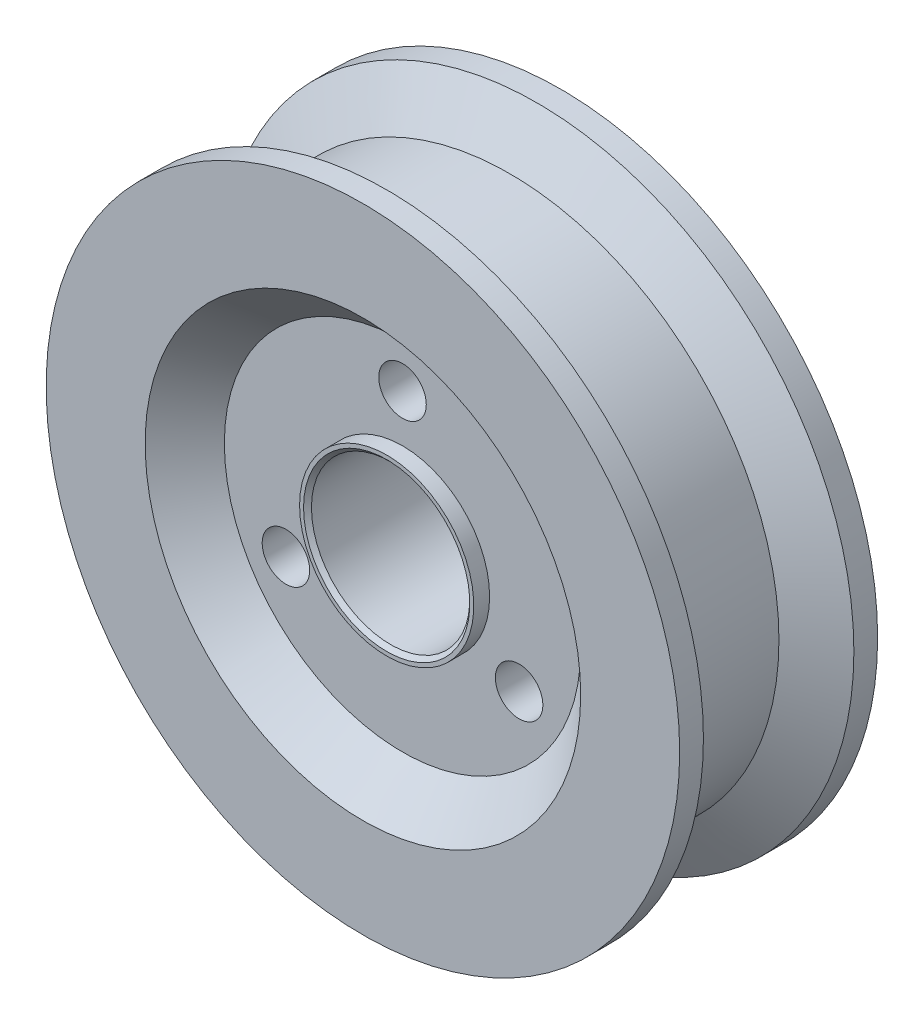
ISO-10303-21;
HEADER;
FILE_DESCRIPTION(('STEP AP214'),'2;1');
FILE_NAME('part.step','',(''),(''),'','','');
FILE_SCHEMA(('AUTOMOTIVE_DESIGN { 1 0 10303 214 1 1 1 1 }'));
ENDSEC;
DATA;
#1=APPLICATION_CONTEXT('core data for automotive mechanical design processes');
#2=APPLICATION_PROTOCOL_DEFINITION('international standard','automotive_design',2000,#1);
#3=PRODUCT_CONTEXT('',#1,'mechanical');
#4=PRODUCT('Part','Part','',(#3));
#5=PRODUCT_RELATED_PRODUCT_CATEGORY('part','',(#4));
#6=PRODUCT_DEFINITION_FORMATION('','',#4);
#7=PRODUCT_DEFINITION_CONTEXT('part definition',#1,'design');
#8=PRODUCT_DEFINITION('design','',#6,#7);
#9=PRODUCT_DEFINITION_SHAPE('','',#8);
#10=(LENGTH_UNIT() NAMED_UNIT(*) SI_UNIT(.MILLI.,.METRE.));
#11=(NAMED_UNIT(*) PLANE_ANGLE_UNIT() SI_UNIT($,.RADIAN.));
#12=(NAMED_UNIT(*) SI_UNIT($,.STERADIAN.) SOLID_ANGLE_UNIT());
#13=UNCERTAINTY_MEASURE_WITH_UNIT(LENGTH_MEASURE(1.E-05),#10,'distance_accuracy_value','');
#14=(GEOMETRIC_REPRESENTATION_CONTEXT(3) GLOBAL_UNCERTAINTY_ASSIGNED_CONTEXT((#13)) GLOBAL_UNIT_ASSIGNED_CONTEXT((#10,
#11,#12)) REPRESENTATION_CONTEXT('',''));
#15=CARTESIAN_POINT('',(0.,0.,0.));
#16=DIRECTION('',(0.,0.,1.));
#17=DIRECTION('',(1.,0.,0.));
#18=AXIS2_PLACEMENT_3D('',#15,#16,#17);
#19=CARTESIAN_POINT('',(0.,0.,9.895));
#20=DIRECTION('',(0.,0.,-1.));
#21=DIRECTION('',(-1.,0.,0.));
#22=AXIS2_PLACEMENT_3D('',#19,#20,#21);
#23=CYLINDRICAL_SURFACE('',#22,31.664);
#24=CARTESIAN_POINT('',(0.,0.,-7.5202));
#25=DIRECTION('',(0.,0.,1.));
#26=DIRECTION('',(1.,0.,0.));
#27=AXIS2_PLACEMENT_3D('',#24,#25,#26);
#28=CIRCLE('',#27,31.664);
#29=CARTESIAN_POINT('',(31.664,0.,-7.5202));
#30=VERTEX_POINT('',#29);
#31=EDGE_CURVE('E95',#30,#30,#28,.T.);
#32=ORIENTED_EDGE('',*,*,#31,.F.);
#33=EDGE_LOOP('',(#32));
#34=FACE_BOUND('',#33,.T.);
#35=CARTESIAN_POINT('',(0.,0.,-9.895));
#36=DIRECTION('',(0.,0.,1.));
#37=DIRECTION('',(1.,0.,0.));
#38=AXIS2_PLACEMENT_3D('',#35,#36,#37);
#39=CIRCLE('',#38,31.664);
#40=CARTESIAN_POINT('',(31.664,0.,-9.895));
#41=VERTEX_POINT('',#40);
#42=EDGE_CURVE('E80',#41,#41,#39,.T.);
#43=ORIENTED_EDGE('',*,*,#42,.T.);
#44=EDGE_LOOP('',(#43));
#45=FACE_BOUND('',#44,.T.);
#46=ADVANCED_FACE('F42',(#34,#45),#23,.T.);
#47=CARTESIAN_POINT('',(0.,0.,9.895));
#48=DIRECTION('',(0.,0.,1.));
#49=DIRECTION('',(1.,0.,0.));
#50=AXIS2_PLACEMENT_3D('',#47,#48,#49);
#51=PLANE('',#50);
#52=CARTESIAN_POINT('',(0.,0.,9.895));
#53=DIRECTION('',(0.,0.,1.));
#54=DIRECTION('',(1.,0.,0.));
#55=AXIS2_PLACEMENT_3D('',#52,#53,#54);
#56=CIRCLE('',#55,21.769);
#57=CARTESIAN_POINT('',(21.769,0.,9.895));
#58=VERTEX_POINT('',#57);
#59=EDGE_CURVE('E75',#58,#58,#56,.F.);
#60=ORIENTED_EDGE('',*,*,#59,.T.);
#61=EDGE_LOOP('',(#60));
#62=FACE_BOUND('',#61,.T.);
#63=CARTESIAN_POINT('',(0.,0.,9.895));
#64=DIRECTION('',(0.,0.,1.));
#65=DIRECTION('',(1.,0.,0.));
#66=AXIS2_PLACEMENT_3D('',#63,#64,#65);
#67=CIRCLE('',#66,31.664);
#68=CARTESIAN_POINT('',(31.664,0.,9.895));
#69=VERTEX_POINT('',#68);
#70=EDGE_CURVE('E79',#69,#69,#67,.T.);
#71=ORIENTED_EDGE('',*,*,#70,.T.);
#72=EDGE_LOOP('',(#71));
#73=FACE_BOUND('',#72,.T.);
#74=ADVANCED_FACE('F168',(#62,#73),#51,.T.);
#75=CARTESIAN_POINT('',(0.,0.,-9.895));
#76=DIRECTION('',(0.,0.,1.));
#77=DIRECTION('',(1.,0.,0.));
#78=AXIS2_PLACEMENT_3D('',#75,#76,#77);
#79=PLANE('',#78);
#80=CARTESIAN_POINT('',(0.,0.,-9.895));
#81=DIRECTION('',(0.,0.,1.));
#82=DIRECTION('',(1.,0.,0.));
#83=AXIS2_PLACEMENT_3D('',#80,#81,#82);
#84=CIRCLE('',#83,21.769);
#85=CARTESIAN_POINT('',(-21.769,0.,-9.895));
#86=VERTEX_POINT('',#85);
#87=EDGE_CURVE('E71',#86,#86,#84,.T.);
#88=ORIENTED_EDGE('',*,*,#87,.T.);
#89=EDGE_LOOP('',(#88));
#90=FACE_BOUND('',#89,.T.);
#91=ORIENTED_EDGE('',*,*,#42,.F.);
#92=EDGE_LOOP('',(#91));
#93=FACE_BOUND('',#92,.T.);
#94=ADVANCED_FACE('F175',(#90,#93),#79,.F.);
#95=CARTESIAN_POINT('',(0.,0.,7.5202));
#96=DIRECTION('',(0.,0.,1.));
#97=DIRECTION('',(1.,0.,0.));
#98=AXIS2_PLACEMENT_3D('',#95,#96,#97);
#99=CIRCLE('',#98,31.664);
#100=CARTESIAN_POINT('',(31.664,0.,7.5202));
#101=VERTEX_POINT('',#100);
#102=EDGE_CURVE('E107',#101,#101,#99,.T.);
#103=ORIENTED_EDGE('',*,*,#102,.T.);
#104=EDGE_LOOP('',(#103));
#105=FACE_BOUND('',#104,.T.);
#106=ORIENTED_EDGE('',*,*,#70,.F.);
#107=EDGE_LOOP('',(#106));
#108=FACE_BOUND('',#107,.T.);
#109=ADVANCED_FACE('F171',(#105,#108),#23,.T.);
#110=CARTESIAN_POINT('',(0.,0.,5.937));
#111=DIRECTION('',(0.,0.,1.));
#112=DIRECTION('',(1.,0.,0.));
#113=AXIS2_PLACEMENT_3D('',#110,#111,#112);
#114=PLANE('',#113);
#115=CARTESIAN_POINT('',(0.,0.,5.937));
#116=DIRECTION('',(0.,0.,1.));
#117=DIRECTION('',(1.,0.,0.));
#118=AXIS2_PLACEMENT_3D('',#115,#116,#117);
#119=CIRCLE('',#118,8.7076);
#120=CARTESIAN_POINT('',(8.7076,0.,5.937));
#121=VERTEX_POINT('',#120);
#122=EDGE_CURVE('E66',#121,#121,#119,.T.);
#123=ORIENTED_EDGE('',*,*,#122,.F.);
#124=EDGE_LOOP('',(#123));
#125=FACE_BOUND('',#124,.T.);
#126=CARTESIAN_POINT('',(0.,13.4572,5.937));
#127=DIRECTION('',(0.,0.,1.));
#128=DIRECTION('',(1.,0.,0.));
#129=AXIS2_PLACEMENT_3D('',#126,#127,#128);
#130=CIRCLE('',#129,2.3748);
#131=CARTESIAN_POINT('',(2.3748,13.4572,5.937));
#132=VERTEX_POINT('',#131);
#133=EDGE_CURVE('E111',#132,#132,#130,.T.);
#134=ORIENTED_EDGE('',*,*,#133,.F.);
#135=EDGE_LOOP('',(#134));
#136=FACE_BOUND('',#135,.T.);
#137=CARTESIAN_POINT('',(-11.6542770638079,-6.7285999999995,5.937));
#138=DIRECTION('',(0.,0.,1.));
#139=DIRECTION('',(1.,0.,0.));
#140=AXIS2_PLACEMENT_3D('',#137,#138,#139);
#141=CIRCLE('',#140,2.37480000000055);
#142=CARTESIAN_POINT('',(-9.2794770638074,-6.7285999999995,5.937));
#143=VERTEX_POINT('',#142);
#144=EDGE_CURVE('E115',#143,#143,#141,.T.);
#145=ORIENTED_EDGE('',*,*,#144,.F.);
#146=EDGE_LOOP('',(#145));
#147=FACE_BOUND('',#146,.T.);
#148=CARTESIAN_POINT('',(11.6542770638075,-6.72859999999975,5.937));
#149=DIRECTION('',(0.,0.,1.));
#150=DIRECTION('',(1.,0.,0.));
#151=AXIS2_PLACEMENT_3D('',#148,#149,#150);
#152=CIRCLE('',#151,2.37480000000027);
#153=CARTESIAN_POINT('',(14.0290770638078,-6.72859999999975,5.937));
#154=VERTEX_POINT('',#153);
#155=EDGE_CURVE('E119',#154,#154,#152,.T.);
#156=ORIENTED_EDGE('',*,*,#155,.F.);
#157=EDGE_LOOP('',(#156));
#158=FACE_BOUND('',#157,.T.);
#159=CARTESIAN_POINT('',(0.,0.,5.937));
#160=DIRECTION('',(0.,0.,1.));
#161=DIRECTION('',(1.,0.,0.));
#162=AXIS2_PLACEMENT_3D('',#159,#160,#161);
#163=CIRCLE('',#162,17.811);
#164=CARTESIAN_POINT('',(17.811,0.,5.937));
#165=VERTEX_POINT('',#164);
#166=EDGE_CURVE('E84',#165,#165,#163,.T.);
#167=ORIENTED_EDGE('',*,*,#166,.T.);
#168=EDGE_LOOP('',(#167));
#169=FACE_BOUND('',#168,.T.);
#170=ADVANCED_FACE('F183',(#125,#136,#147,#158,#169),#114,.T.);
#171=CARTESIAN_POINT('',(0.,0.,-5.937));
#172=DIRECTION('',(0.,0.,-1.));
#173=DIRECTION('',(1.,0.,0.));
#174=AXIS2_PLACEMENT_3D('',#171,#172,#173);
#175=PLANE('',#174);
#176=CARTESIAN_POINT('',(0.,0.,-5.937));
#177=DIRECTION('',(0.,0.,-1.));
#178=DIRECTION('',(-1.,0.,0.));
#179=AXIS2_PLACEMENT_3D('',#176,#177,#178);
#180=CIRCLE('',#179,8.7076);
#181=CARTESIAN_POINT('',(-8.7076,0.,-5.937));
#182=VERTEX_POINT('',#181);
#183=EDGE_CURVE('E67',#182,#182,#180,.T.);
#184=ORIENTED_EDGE('',*,*,#183,.F.);
#185=EDGE_LOOP('',(#184));
#186=FACE_BOUND('',#185,.T.);
#187=CARTESIAN_POINT('',(0.,13.4572,-5.937));
#188=DIRECTION('',(0.,0.,-1.));
#189=DIRECTION('',(-1.,0.,0.));
#190=AXIS2_PLACEMENT_3D('',#187,#188,#189);
#191=CIRCLE('',#190,2.3748);
#192=CARTESIAN_POINT('',(-2.3748,13.4572,-5.937));
#193=VERTEX_POINT('',#192);
#194=EDGE_CURVE('E123',#193,#193,#191,.T.);
#195=ORIENTED_EDGE('',*,*,#194,.F.);
#196=EDGE_LOOP('',(#195));
#197=FACE_BOUND('',#196,.T.);
#198=CARTESIAN_POINT('',(-11.6542770638079,-6.7285999999995,-5.937));
#199=DIRECTION('',(0.,0.,-1.));
#200=DIRECTION('',(-1.,0.,0.));
#201=AXIS2_PLACEMENT_3D('',#198,#199,#200);
#202=CIRCLE('',#201,2.37480000000055);
#203=CARTESIAN_POINT('',(-14.0290770638085,-6.7285999999995,-5.937));
#204=VERTEX_POINT('',#203);
#205=EDGE_CURVE('E128',#204,#204,#202,.T.);
#206=ORIENTED_EDGE('',*,*,#205,.F.);
#207=EDGE_LOOP('',(#206));
#208=FACE_BOUND('',#207,.T.);
#209=CARTESIAN_POINT('',(11.6542770638075,-6.72859999999975,-5.937));
#210=DIRECTION('',(0.,0.,-1.));
#211=DIRECTION('',(-1.,0.,0.));
#212=AXIS2_PLACEMENT_3D('',#209,#210,#211);
#213=CIRCLE('',#212,2.37480000000027);
#214=CARTESIAN_POINT('',(9.27947706380725,-6.72859999999975,-5.937));
#215=VERTEX_POINT('',#214);
#216=EDGE_CURVE('E124',#215,#215,#213,.T.);
#217=ORIENTED_EDGE('',*,*,#216,.F.);
#218=EDGE_LOOP('',(#217));
#219=FACE_BOUND('',#218,.T.);
#220=CARTESIAN_POINT('',(0.,0.,-5.937));
#221=DIRECTION('',(0.,0.,1.));
#222=DIRECTION('',(1.,0.,0.));
#223=AXIS2_PLACEMENT_3D('',#220,#221,#222);
#224=CIRCLE('',#223,17.811);
#225=CARTESIAN_POINT('',(-17.811,0.,-5.937));
#226=VERTEX_POINT('',#225);
#227=EDGE_CURVE('E91',#226,#226,#224,.T.);
#228=ORIENTED_EDGE('',*,*,#227,.F.);
#229=EDGE_LOOP('',(#228));
#230=FACE_BOUND('',#229,.T.);
#231=ADVANCED_FACE('F189',(#186,#197,#208,#219,#230),#175,.T.);
#232=CARTESIAN_POINT('',(0.,0.,-7.5202));
#233=DIRECTION('',(0.,0.,-1.));
#234=DIRECTION('',(-1.,0.,0.));
#235=AXIS2_PLACEMENT_3D('',#232,#233,#234);
#236=CONICAL_SURFACE('',#235,31.664,1.04719755119659);
#237=CARTESIAN_POINT('',(0.,0.,-4.77801716145693));
#238=DIRECTION('',(0.,0.,1.));
#239=DIRECTION('',(1.,0.,0.));
#240=AXIS2_PLACEMENT_3D('',#237,#238,#239);
#241=CIRCLE('',#240,26.9144);
#242=CARTESIAN_POINT('',(26.9144,0.,-4.77801716145693));
#243=VERTEX_POINT('',#242);
#244=EDGE_CURVE('E99',#243,#243,#241,.T.);
#245=ORIENTED_EDGE('',*,*,#244,.F.);
#246=EDGE_LOOP('',(#245));
#247=FACE_BOUND('',#246,.T.);
#248=ORIENTED_EDGE('',*,*,#31,.T.);
#249=EDGE_LOOP('',(#248));
#250=FACE_BOUND('',#249,.T.);
#251=ADVANCED_FACE('F208',(#247,#250),#236,.T.);
#252=CARTESIAN_POINT('',(0.,0.,0.));
#253=DIRECTION('',(0.,0.,1.));
#254=DIRECTION('',(1.,0.,0.));
#255=AXIS2_PLACEMENT_3D('',#252,#253,#254);
#256=CYLINDRICAL_SURFACE('',#255,26.9144);
#257=CARTESIAN_POINT('',(0.,0.,4.77801716145692));
#258=DIRECTION('',(0.,0.,1.));
#259=DIRECTION('',(1.,0.,0.));
#260=AXIS2_PLACEMENT_3D('',#257,#258,#259);
#261=CIRCLE('',#260,26.9144);
#262=CARTESIAN_POINT('',(26.9144,0.,4.77801716145692));
#263=VERTEX_POINT('',#262);
#264=EDGE_CURVE('E103',#263,#263,#261,.T.);
#265=ORIENTED_EDGE('',*,*,#264,.F.);
#266=EDGE_LOOP('',(#265));
#267=FACE_BOUND('',#266,.T.);
#268=ORIENTED_EDGE('',*,*,#244,.T.);
#269=EDGE_LOOP('',(#268));
#270=FACE_BOUND('',#269,.T.);
#271=ADVANCED_FACE('F202',(#267,#270),#256,.T.);
#272=CARTESIAN_POINT('',(0.,0.,4.77801716145692));
#273=DIRECTION('',(0.,0.,1.));
#274=DIRECTION('',(1.,0.,0.));
#275=AXIS2_PLACEMENT_3D('',#272,#273,#274);
#276=CONICAL_SURFACE('',#275,26.9144,1.04719755119659);
#277=ORIENTED_EDGE('',*,*,#102,.F.);
#278=EDGE_LOOP('',(#277));
#279=FACE_BOUND('',#278,.T.);
#280=ORIENTED_EDGE('',*,*,#264,.T.);
#281=EDGE_LOOP('',(#280));
#282=FACE_BOUND('',#281,.T.);
#283=ADVANCED_FACE('F198',(#279,#282),#276,.T.);
#284=CARTESIAN_POINT('',(0.,0.,5.93700000000002));
#285=DIRECTION('',(0.,0.,1.));
#286=DIRECTION('',(1.,0.,0.));
#287=AXIS2_PLACEMENT_3D('',#284,#285,#286);
#288=CONICAL_SURFACE('',#287,17.811,0.78539816339745);
#289=ORIENTED_EDGE('',*,*,#59,.F.);
#290=EDGE_LOOP('',(#289));
#291=FACE_BOUND('',#290,.T.);
#292=ORIENTED_EDGE('',*,*,#166,.F.);
#293=EDGE_LOOP('',(#292));
#294=FACE_BOUND('',#293,.T.);
#295=ADVANCED_FACE('F201',(#291,#294),#288,.F.);
#296=CARTESIAN_POINT('',(0.,0.,-9.895));
#297=DIRECTION('',(0.,0.,-1.));
#298=DIRECTION('',(-1.,0.,0.));
#299=AXIS2_PLACEMENT_3D('',#296,#297,#298);
#300=CONICAL_SURFACE('',#299,21.769,0.785398163397447);
#301=CARTESIAN_POINT('',(-17.811,0.,-5.937));
#302=CARTESIAN_POINT('',(-17.8522291666667,0.,-5.97822916666667));
#303=CARTESIAN_POINT('',(-17.8934583333334,0.,-6.01945833333333));
#304=CARTESIAN_POINT('',(-17.9759166666667,0.,-6.10191666666667));
#305=CARTESIAN_POINT('',(-18.0171458333334,0.,-6.14314583333333));
#306=CARTESIAN_POINT('',(-18.0996041666667,0.,-6.22560416666667));
#307=CARTESIAN_POINT('',(-18.1408333333334,0.,-6.26683333333333));
#308=CARTESIAN_POINT('',(-18.2232916666667,0.,-6.34929166666667));
#309=CARTESIAN_POINT('',(-18.2645208333334,0.,-6.39052083333333));
#310=CARTESIAN_POINT('',(-18.3469791666667,0.,-6.47297916666667));
#311=CARTESIAN_POINT('',(-18.3882083333333,0.,-6.51420833333333));
#312=CARTESIAN_POINT('',(-18.4706666666667,0.,-6.59666666666667));
#313=CARTESIAN_POINT('',(-18.5118958333334,0.,-6.63789583333333));
#314=CARTESIAN_POINT('',(-18.5943541666667,0.,-6.72035416666667));
#315=CARTESIAN_POINT('',(-18.6355833333334,0.,-6.76158333333333));
#316=CARTESIAN_POINT('',(-18.7180416666667,0.,-6.84404166666667));
#317=CARTESIAN_POINT('',(-18.7592708333334,0.,-6.88527083333333));
#318=CARTESIAN_POINT('',(-18.8417291666667,0.,-6.96772916666667));
#319=CARTESIAN_POINT('',(-18.8829583333333,0.,-7.00895833333333));
#320=CARTESIAN_POINT('',(-18.9654166666667,0.,-7.09141666666667));
#321=CARTESIAN_POINT('',(-19.0066458333333,0.,-7.13264583333333));
#322=CARTESIAN_POINT('',(-19.0891041666667,0.,-7.21510416666667));
#323=CARTESIAN_POINT('',(-19.1303333333334,0.,-7.25633333333333));
#324=CARTESIAN_POINT('',(-19.2127916666667,0.,-7.33879166666667));
#325=CARTESIAN_POINT('',(-19.2540208333333,0.,-7.38002083333333));
#326=CARTESIAN_POINT('',(-19.3364791666667,0.,-7.46247916666667));
#327=CARTESIAN_POINT('',(-19.3777083333333,0.,-7.50370833333333));
#328=CARTESIAN_POINT('',(-19.4601666666667,0.,-7.58616666666667));
#329=CARTESIAN_POINT('',(-19.5013958333333,0.,-7.62739583333333));
#330=CARTESIAN_POINT('',(-19.5838541666667,0.,-7.70985416666667));
#331=CARTESIAN_POINT('',(-19.6250833333334,0.,-7.75108333333333));
#332=CARTESIAN_POINT('',(-19.7075416666667,0.,-7.83354166666667));
#333=CARTESIAN_POINT('',(-19.7487708333333,0.,-7.87477083333333));
#334=CARTESIAN_POINT('',(-19.8312291666667,0.,-7.95722916666667));
#335=CARTESIAN_POINT('',(-19.8724583333333,0.,-7.99845833333333));
#336=CARTESIAN_POINT('',(-19.9549166666667,0.,-8.08091666666667));
#337=CARTESIAN_POINT('',(-19.9961458333333,0.,-8.12214583333333));
#338=CARTESIAN_POINT('',(-20.0786041666667,0.,-8.20460416666667));
#339=CARTESIAN_POINT('',(-20.1198333333333,0.,-8.24583333333333));
#340=CARTESIAN_POINT('',(-20.2022916666667,0.,-8.32829166666667));
#341=CARTESIAN_POINT('',(-20.2435208333333,0.,-8.36952083333333));
#342=CARTESIAN_POINT('',(-20.3259791666667,0.,-8.45197916666667));
#343=CARTESIAN_POINT('',(-20.3672083333333,0.,-8.49320833333334));
#344=CARTESIAN_POINT('',(-20.4496666666667,0.,-8.57566666666667));
#345=CARTESIAN_POINT('',(-20.4908958333333,0.,-8.61689583333333));
#346=CARTESIAN_POINT('',(-20.5733541666667,0.,-8.69935416666667));
#347=CARTESIAN_POINT('',(-20.6145833333333,0.,-8.74058333333334));
#348=CARTESIAN_POINT('',(-20.6970416666667,0.,-8.82304166666667));
#349=CARTESIAN_POINT('',(-20.7382708333333,0.,-8.86427083333334));
#350=CARTESIAN_POINT('',(-20.8207291666667,0.,-8.94672916666667));
#351=CARTESIAN_POINT('',(-20.8619583333333,0.,-8.98795833333333));
#352=CARTESIAN_POINT('',(-20.9444166666667,0.,-9.07041666666667));
#353=CARTESIAN_POINT('',(-20.9856458333333,0.,-9.11164583333333));
#354=CARTESIAN_POINT('',(-21.0681041666667,0.,-9.19410416666667));
#355=CARTESIAN_POINT('',(-21.1093333333333,0.,-9.23533333333333));
#356=CARTESIAN_POINT('',(-21.1917916666667,0.,-9.31779166666667));
#357=CARTESIAN_POINT('',(-21.2330208333333,0.,-9.35902083333334));
#358=CARTESIAN_POINT('',(-21.3154791666667,0.,-9.44147916666667));
#359=CARTESIAN_POINT('',(-21.3567083333333,0.,-9.48270833333333));
#360=CARTESIAN_POINT('',(-21.4391666666667,0.,-9.56516666666667));
#361=CARTESIAN_POINT('',(-21.4803958333333,0.,-9.60639583333334));
#362=CARTESIAN_POINT('',(-21.5628541666667,0.,-9.68885416666667));
#363=CARTESIAN_POINT('',(-21.6040833333333,0.,-9.73008333333333));
#364=CARTESIAN_POINT('',(-21.6865416666667,0.,-9.81254166666667));
#365=CARTESIAN_POINT('',(-21.7277708333333,0.,-9.85377083333333));
#366=CARTESIAN_POINT('',(-21.769,0.,-9.895));
#367=B_SPLINE_CURVE_WITH_KNOTS('',3,(#301,#302,#303,#304,#305,#306,#307,#308,#309,#310,#311,
#312,#313,#314,#315,#316,#317,#318,#319,#320,#321,#322,#323,#324,#325,#326,#327,#328,#329,#330,
#331,#332,#333,#334,#335,#336,#337,#338,#339,#340,#341,#342,#343,#344,#345,#346,#347,#348,#349,
#350,#351,#352,#353,#354,#355,#356,#357,#358,#359,#360,#361,#362,#363,#364,#365,#366),
.UNSPECIFIED.,.F.,.F.,(4,2,2,2,2,2,2,2,2,2,2,2,2,2,2,2,2,2,2,2,2,2,2,2,2,2,2,2,2,2,2,2,4),(0.,
0.17492053999602,0.349841079992043,0.524761619988065,0.699682159984088,0.874602699980108,
1.04952323997613,1.22444377997215,1.39936431996818,1.5742848599642,1.74920539996022,
1.92412593995624,2.09904647995226,2.27396701994828,2.44888755994431,2.62380809994033,
2.79872863993635,2.97364917993237,3.14856971992839,3.32349025992442,3.49841079992044,
3.67333133991646,3.84825187991248,4.02317241990851,4.19809295990453,4.37301349990055,
4.54793403989657,4.72285457989259,4.89777511988861,5.07269565988464,5.24761619988066,
5.42253673987668,5.5974572798727),.UNSPECIFIED.);
#368=EDGE_CURVE('BSEAM293',#226,#86,#367,.T.);
#369=ORIENTED_EDGE('',*,*,#227,.T.);
#370=ORIENTED_EDGE('',*,*,#87,.F.);
#371=ORIENTED_EDGE('',*,*,#368,.T.);
#372=ORIENTED_EDGE('',*,*,#368,.F.);
#373=EDGE_LOOP('',(#369,#371,#370,#372));
#374=FACE_BOUND('',#373,.T.);
#375=ADVANCED_FACE('F293',(#374),#300,.F.);
#376=CARTESIAN_POINT('',(11.6542770638075,-6.72859999999975,9.895));
#377=DIRECTION('',(0.,0.,-1.));
#378=DIRECTION('',(-1.,0.,0.));
#379=AXIS2_PLACEMENT_3D('',#376,#377,#378);
#380=CYLINDRICAL_SURFACE('',#379,2.37480000000027);
#381=ORIENTED_EDGE('',*,*,#155,.T.);
#382=EDGE_LOOP('',(#381));
#383=FACE_BOUND('',#382,.T.);
#384=ORIENTED_EDGE('',*,*,#216,.T.);
#385=EDGE_LOOP('',(#384));
#386=FACE_BOUND('',#385,.T.);
#387=ADVANCED_FACE('F283',(#383,#386),#380,.F.);
#388=CARTESIAN_POINT('',(-11.6542770638079,-6.7285999999995,9.895));
#389=DIRECTION('',(0.,0.,-1.));
#390=DIRECTION('',(-1.,0.,0.));
#391=AXIS2_PLACEMENT_3D('',#388,#389,#390);
#392=CYLINDRICAL_SURFACE('',#391,2.37480000000055);
#393=ORIENTED_EDGE('',*,*,#144,.T.);
#394=EDGE_LOOP('',(#393));
#395=FACE_BOUND('',#394,.T.);
#396=ORIENTED_EDGE('',*,*,#205,.T.);
#397=EDGE_LOOP('',(#396));
#398=FACE_BOUND('',#397,.T.);
#399=ADVANCED_FACE('F160',(#395,#398),#392,.F.);
#400=CARTESIAN_POINT('',(0.,13.4572,9.895));
#401=DIRECTION('',(0.,0.,-1.));
#402=DIRECTION('',(-1.,0.,0.));
#403=AXIS2_PLACEMENT_3D('',#400,#401,#402);
#404=CYLINDRICAL_SURFACE('',#403,2.3748);
#405=ORIENTED_EDGE('',*,*,#133,.T.);
#406=EDGE_LOOP('',(#405));
#407=FACE_BOUND('',#406,.T.);
#408=ORIENTED_EDGE('',*,*,#194,.T.);
#409=EDGE_LOOP('',(#408));
#410=FACE_BOUND('',#409,.T.);
#411=ADVANCED_FACE('F151',(#407,#410),#404,.F.);
#412=CARTESIAN_POINT('',(0.,0.,7.5202));
#413=DIRECTION('',(0.,0.,-1.));
#414=DIRECTION('',(-1.,0.,0.));
#415=AXIS2_PLACEMENT_3D('',#412,#413,#414);
#416=CYLINDRICAL_SURFACE('',#415,8.7076);
#417=ORIENTED_EDGE('',*,*,#183,.T.);
#418=EDGE_LOOP('',(#417));
#419=FACE_BOUND('',#418,.T.);
#420=CARTESIAN_POINT('',(0.,0.,-7.5202));
#421=DIRECTION('',(0.,0.,-1.));
#422=DIRECTION('',(-1.,0.,0.));
#423=AXIS2_PLACEMENT_3D('',#420,#421,#422);
#424=CIRCLE('',#423,8.7076);
#425=CARTESIAN_POINT('',(-8.7076,0.,-7.5202));
#426=VERTEX_POINT('',#425);
#427=EDGE_CURVE('E142',#426,#426,#424,.T.);
#428=ORIENTED_EDGE('',*,*,#427,.F.);
#429=EDGE_LOOP('',(#428));
#430=FACE_BOUND('',#429,.T.);
#431=ADVANCED_FACE('F149',(#419,#430),#416,.T.);
#432=CARTESIAN_POINT('',(0.,0.,-7.5202));
#433=DIRECTION('',(0.,0.,-1.));
#434=DIRECTION('',(-1.,0.,0.));
#435=AXIS2_PLACEMENT_3D('',#432,#433,#434);
#436=PLANE('',#435);
#437=CARTESIAN_POINT('',(0.,0.,-7.5202));
#438=DIRECTION('',(0.,0.,-1.));
#439=DIRECTION('',(-1.,0.,0.));
#440=AXIS2_PLACEMENT_3D('',#437,#438,#439);
#441=CIRCLE('',#440,8.31180000000003);
#442=CARTESIAN_POINT('',(-8.31180000000003,0.,-7.5202));
#443=VERTEX_POINT('',#442);
#444=EDGE_CURVE('E10',#443,#443,#441,.F.);
#445=ORIENTED_EDGE('',*,*,#444,.T.);
#446=EDGE_LOOP('',(#445));
#447=FACE_BOUND('',#446,.T.);
#448=ORIENTED_EDGE('',*,*,#427,.T.);
#449=EDGE_LOOP('',(#448));
#450=FACE_BOUND('',#449,.T.);
#451=ADVANCED_FACE('F147',(#447,#450),#436,.T.);
#452=ORIENTED_EDGE('',*,*,#122,.T.);
#453=EDGE_LOOP('',(#452));
#454=FACE_BOUND('',#453,.T.);
#455=CARTESIAN_POINT('',(0.,0.,7.5202));
#456=DIRECTION('',(0.,0.,-1.));
#457=DIRECTION('',(-1.,0.,0.));
#458=AXIS2_PLACEMENT_3D('',#455,#456,#457);
#459=CIRCLE('',#458,8.7076);
#460=CARTESIAN_POINT('',(-8.7076,0.,7.5202));
#461=VERTEX_POINT('',#460);
#462=EDGE_CURVE('E129',#461,#461,#459,.T.);
#463=ORIENTED_EDGE('',*,*,#462,.T.);
#464=EDGE_LOOP('',(#463));
#465=FACE_BOUND('',#464,.T.);
#466=ADVANCED_FACE('F154',(#454,#465),#416,.T.);
#467=CARTESIAN_POINT('',(0.,0.,7.5202));
#468=DIRECTION('',(0.,0.,-1.));
#469=DIRECTION('',(-1.,0.,0.));
#470=AXIS2_PLACEMENT_3D('',#467,#468,#469);
#471=PLANE('',#470);
#472=CARTESIAN_POINT('',(0.,0.,7.5202));
#473=DIRECTION('',(0.,0.,-1.));
#474=DIRECTION('',(-1.,0.,0.));
#475=AXIS2_PLACEMENT_3D('',#472,#473,#474);
#476=CIRCLE('',#475,8.31180000000001);
#477=CARTESIAN_POINT('',(-8.31180000000001,0.,7.5202));
#478=VERTEX_POINT('',#477);
#479=EDGE_CURVE('E60',#478,#478,#476,.T.);
#480=ORIENTED_EDGE('',*,*,#479,.T.);
#481=EDGE_LOOP('',(#480));
#482=FACE_BOUND('',#481,.T.);
#483=ORIENTED_EDGE('',*,*,#462,.F.);
#484=EDGE_LOOP('',(#483));
#485=FACE_BOUND('',#484,.T.);
#486=ADVANCED_FACE('F165',(#482,#485),#471,.F.);
#487=CARTESIAN_POINT('',(0.,0.,9.895));
#488=DIRECTION('',(0.,0.,-1.));
#489=DIRECTION('',(-1.,0.,0.));
#490=AXIS2_PLACEMENT_3D('',#487,#488,#489);
#491=CYLINDRICAL_SURFACE('',#490,7.916);
#492=CARTESIAN_POINT('',(0.,0.,7.1244));
#493=DIRECTION('',(0.,0.,-1.));
#494=DIRECTION('',(-1.,0.,0.));
#495=AXIS2_PLACEMENT_3D('',#492,#493,#494);
#496=CIRCLE('',#495,7.916);
#497=CARTESIAN_POINT('',(-7.916,0.,7.1244));
#498=VERTEX_POINT('',#497);
#499=EDGE_CURVE('E50',#498,#498,#496,.F.);
#500=ORIENTED_EDGE('',*,*,#499,.T.);
#501=EDGE_LOOP('',(#500));
#502=FACE_BOUND('',#501,.T.);
#503=CARTESIAN_POINT('',(0.,0.,-7.12439999999998));
#504=DIRECTION('',(0.,0.,-1.));
#505=DIRECTION('',(-1.,0.,0.));
#506=AXIS2_PLACEMENT_3D('',#503,#504,#505);
#507=CIRCLE('',#506,7.916);
#508=CARTESIAN_POINT('',(-7.916,0.,-7.12439999999998));
#509=VERTEX_POINT('',#508);
#510=EDGE_CURVE('E55',#509,#509,#507,.T.);
#511=ORIENTED_EDGE('',*,*,#510,.T.);
#512=EDGE_LOOP('',(#511));
#513=FACE_BOUND('',#512,.T.);
#514=ADVANCED_FACE('F221',(#502,#513),#491,.F.);
#515=CARTESIAN_POINT('',(0.,0.,7.5202));
#516=DIRECTION('',(0.,0.,1.));
#517=DIRECTION('',(1.,0.,0.));
#518=AXIS2_PLACEMENT_3D('',#515,#516,#517);
#519=CONICAL_SURFACE('',#518,8.31180000000001,0.785398163397455);
#520=ORIENTED_EDGE('',*,*,#499,.F.);
#521=EDGE_LOOP('',(#520));
#522=FACE_BOUND('',#521,.T.);
#523=ORIENTED_EDGE('',*,*,#479,.F.);
#524=EDGE_LOOP('',(#523));
#525=FACE_BOUND('',#524,.T.);
#526=ADVANCED_FACE('F223',(#522,#525),#519,.F.);
#527=CARTESIAN_POINT('',(0.,0.,-7.12439999999998));
#528=DIRECTION('',(0.,0.,-1.));
#529=DIRECTION('',(-1.,0.,0.));
#530=AXIS2_PLACEMENT_3D('',#527,#528,#529);
#531=CONICAL_SURFACE('',#530,7.916,0.785398163397453);
#532=ORIENTED_EDGE('',*,*,#444,.F.);
#533=EDGE_LOOP('',(#532));
#534=FACE_BOUND('',#533,.T.);
#535=ORIENTED_EDGE('',*,*,#510,.F.);
#536=EDGE_LOOP('',(#535));
#537=FACE_BOUND('',#536,.T.);
#538=ADVANCED_FACE('F44',(#534,#537),#531,.F.);
#539=CLOSED_SHELL('',(#46,#74,#94,#109,#170,#231,#251,#271,#283,#295,#375,#387,#399,#411,#431,
#451,#466,#486,#514,#526,#538));
#540=MANIFOLD_SOLID_BREP('B2',#539);
#541=ADVANCED_BREP_SHAPE_REPRESENTATION('',(#18,#540),#14);
#542=SHAPE_DEFINITION_REPRESENTATION(#9,#541);
ENDSEC;
END-ISO-10303-21;
